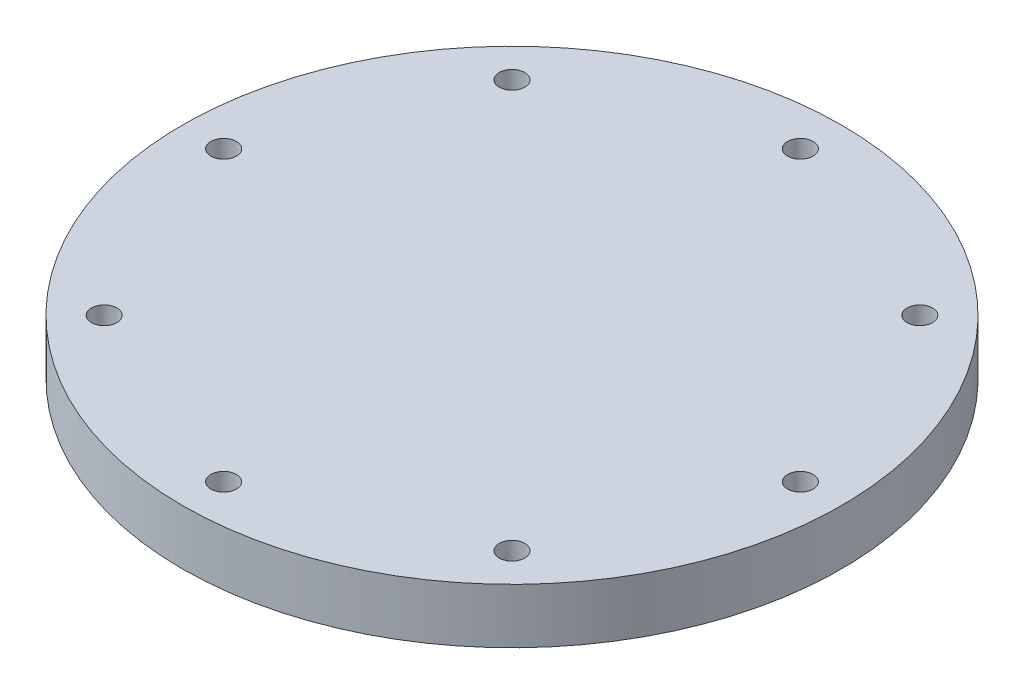
ISO-10303-21;
HEADER;
FILE_DESCRIPTION(('STEP AP214'),'2;1');
FILE_NAME('part.step','',(''),(''),'','','');
FILE_SCHEMA(('AUTOMOTIVE_DESIGN { 1 0 10303 214 1 1 1 1 }'));
ENDSEC;
DATA;
#1=APPLICATION_CONTEXT('core data for automotive mechanical design processes');
#2=APPLICATION_PROTOCOL_DEFINITION('international standard','automotive_design',2000,#1);
#3=PRODUCT_CONTEXT('',#1,'mechanical');
#4=PRODUCT('Part','Part','',(#3));
#5=PRODUCT_RELATED_PRODUCT_CATEGORY('part','',(#4));
#6=PRODUCT_DEFINITION_FORMATION('','',#4);
#7=PRODUCT_DEFINITION_CONTEXT('part definition',#1,'design');
#8=PRODUCT_DEFINITION('design','',#6,#7);
#9=PRODUCT_DEFINITION_SHAPE('','',#8);
#10=(LENGTH_UNIT() NAMED_UNIT(*) SI_UNIT(.MILLI.,.METRE.));
#11=(NAMED_UNIT(*) PLANE_ANGLE_UNIT() SI_UNIT($,.RADIAN.));
#12=(NAMED_UNIT(*) SI_UNIT($,.STERADIAN.) SOLID_ANGLE_UNIT());
#13=UNCERTAINTY_MEASURE_WITH_UNIT(LENGTH_MEASURE(1.E-05),#10,'distance_accuracy_value','');
#14=(GEOMETRIC_REPRESENTATION_CONTEXT(3) GLOBAL_UNCERTAINTY_ASSIGNED_CONTEXT((#13)) GLOBAL_UNIT_ASSIGNED_CONTEXT((#10,
#11,#12)) REPRESENTATION_CONTEXT('',''));
#15=CARTESIAN_POINT('',(0.,0.,0.));
#16=DIRECTION('',(0.,0.,1.));
#17=DIRECTION('',(1.,0.,0.));
#18=AXIS2_PLACEMENT_3D('',#15,#16,#17);
#19=CARTESIAN_POINT('',(0.,0.,0.));
#20=DIRECTION('',(0.,1.,0.));
#21=DIRECTION('',(0.,0.,1.));
#22=AXIS2_PLACEMENT_3D('',#19,#20,#21);
#23=PLANE('',#22);
#24=CARTESIAN_POINT('',(-23.5731723178062,0.,23.5731723178068));
#25=DIRECTION('',(0.,-1.,0.));
#26=DIRECTION('',(0.,0.,-1.));
#27=AXIS2_PLACEMENT_3D('',#24,#25,#26);
#28=CIRCLE('',#27,2.413);
#29=CARTESIAN_POINT('',(-23.5731723178062,0.,21.1601723178068));
#30=VERTEX_POINT('',#29);
#31=EDGE_CURVE('E135',#30,#30,#28,.T.);
#32=ORIENTED_EDGE('',*,*,#31,.F.);
#33=EDGE_LOOP('',(#32));
#34=FACE_BOUND('',#33,.T.);
#35=CARTESIAN_POINT('',(-33.3375,0.,3.49191777401049E-13));
#36=DIRECTION('',(0.,-1.,0.));
#37=DIRECTION('',(0.,0.,-1.));
#38=AXIS2_PLACEMENT_3D('',#35,#36,#37);
#39=CIRCLE('',#38,2.413);
#40=CARTESIAN_POINT('',(-33.3375,0.,-2.41299999999965));
#41=VERTEX_POINT('',#40);
#42=EDGE_CURVE('E123',#41,#41,#39,.T.);
#43=ORIENTED_EDGE('',*,*,#42,.F.);
#44=EDGE_LOOP('',(#43));
#45=FACE_BOUND('',#44,.T.);
#46=CARTESIAN_POINT('',(-23.5731723178067,0.,-23.5731723178063));
#47=DIRECTION('',(0.,-1.,0.));
#48=DIRECTION('',(0.,0.,-1.));
#49=AXIS2_PLACEMENT_3D('',#46,#47,#48);
#50=CIRCLE('',#49,2.413);
#51=CARTESIAN_POINT('',(-23.5731723178067,0.,-25.9861723178063));
#52=VERTEX_POINT('',#51);
#53=EDGE_CURVE('E111',#52,#52,#50,.T.);
#54=ORIENTED_EDGE('',*,*,#53,.F.);
#55=EDGE_LOOP('',(#54));
#56=FACE_BOUND('',#55,.T.);
#57=CARTESIAN_POINT('',(0.,0.,-33.3375));
#58=DIRECTION('',(0.,-1.,0.));
#59=DIRECTION('',(0.,0.,-1.));
#60=AXIS2_PLACEMENT_3D('',#57,#58,#59);
#61=CIRCLE('',#60,2.413);
#62=CARTESIAN_POINT('',(0.,0.,-35.7505));
#63=VERTEX_POINT('',#62);
#64=EDGE_CURVE('E99',#63,#63,#61,.T.);
#65=ORIENTED_EDGE('',*,*,#64,.F.);
#66=EDGE_LOOP('',(#65));
#67=FACE_BOUND('',#66,.T.);
#68=CARTESIAN_POINT('',(23.5731723178064,0.,-23.5731723178067));
#69=DIRECTION('',(0.,-1.,0.));
#70=DIRECTION('',(0.,0.,-1.));
#71=AXIS2_PLACEMENT_3D('',#68,#69,#70);
#72=CIRCLE('',#71,2.413);
#73=CARTESIAN_POINT('',(23.5731723178064,0.,-25.9861723178067));
#74=VERTEX_POINT('',#73);
#75=EDGE_CURVE('E87',#74,#74,#72,.T.);
#76=ORIENTED_EDGE('',*,*,#75,.F.);
#77=EDGE_LOOP('',(#76));
#78=FACE_BOUND('',#77,.T.);
#79=CARTESIAN_POINT('',(23.5731723178066,0.,23.5731723178065));
#80=DIRECTION('',(0.,-1.,0.));
#81=DIRECTION('',(0.,0.,-1.));
#82=AXIS2_PLACEMENT_3D('',#79,#80,#81);
#83=CIRCLE('',#82,2.413);
#84=CARTESIAN_POINT('',(23.5731723178066,0.,21.1601723178065));
#85=VERTEX_POINT('',#84);
#86=EDGE_CURVE('E63',#85,#85,#83,.T.);
#87=ORIENTED_EDGE('',*,*,#86,.F.);
#88=EDGE_LOOP('',(#87));
#89=FACE_BOUND('',#88,.T.);
#90=CARTESIAN_POINT('',(0.,0.,33.3375));
#91=DIRECTION('',(0.,-1.,0.));
#92=DIRECTION('',(0.,0.,-1.));
#93=AXIS2_PLACEMENT_3D('',#90,#91,#92);
#94=CIRCLE('',#93,2.413);
#95=CARTESIAN_POINT('',(0.,0.,30.9245));
#96=VERTEX_POINT('',#95);
#97=EDGE_CURVE('E51',#96,#96,#94,.T.);
#98=ORIENTED_EDGE('',*,*,#97,.F.);
#99=EDGE_LOOP('',(#98));
#100=FACE_BOUND('',#99,.T.);
#101=CARTESIAN_POINT('',(0.,0.,0.));
#102=DIRECTION('',(0.,1.,0.));
#103=DIRECTION('',(0.,0.,1.));
#104=AXIS2_PLACEMENT_3D('',#101,#102,#103);
#105=CIRCLE('',#104,38.1);
#106=CARTESIAN_POINT('',(0.,0.,38.1));
#107=VERTEX_POINT('',#106);
#108=EDGE_CURVE('E34',#107,#107,#105,.T.);
#109=ORIENTED_EDGE('',*,*,#108,.F.);
#110=EDGE_LOOP('',(#109));
#111=FACE_BOUND('',#110,.T.);
#112=CARTESIAN_POINT('',(33.3375,0.,-1.16397259133683E-13));
#113=DIRECTION('',(0.,-1.,0.));
#114=DIRECTION('',(0.,0.,-1.));
#115=AXIS2_PLACEMENT_3D('',#112,#113,#114);
#116=CIRCLE('',#115,2.413);
#117=CARTESIAN_POINT('',(33.3375,0.,-2.41300000000011));
#118=VERTEX_POINT('',#117);
#119=EDGE_CURVE('E75',#118,#118,#116,.T.);
#120=ORIENTED_EDGE('',*,*,#119,.F.);
#121=EDGE_LOOP('',(#120));
#122=FACE_BOUND('',#121,.T.);
#123=ADVANCED_FACE('F30',(#34,#45,#56,#67,#78,#89,#100,#111,#122),#23,.F.);
#124=CARTESIAN_POINT('',(0.,6.35,0.));
#125=DIRECTION('',(0.,-1.,0.));
#126=DIRECTION('',(0.,0.,-1.));
#127=AXIS2_PLACEMENT_3D('',#124,#125,#126);
#128=CYLINDRICAL_SURFACE('',#127,38.1);
#129=CARTESIAN_POINT('',(0.,6.35,0.));
#130=DIRECTION('',(0.,1.,0.));
#131=DIRECTION('',(0.,0.,1.));
#132=AXIS2_PLACEMENT_3D('',#129,#130,#131);
#133=CIRCLE('',#132,38.1);
#134=CARTESIAN_POINT('',(0.,6.35,38.1));
#135=VERTEX_POINT('',#134);
#136=EDGE_CURVE('E10',#135,#135,#133,.T.);
#137=ORIENTED_EDGE('',*,*,#136,.F.);
#138=EDGE_LOOP('',(#137));
#139=FACE_BOUND('',#138,.T.);
#140=ORIENTED_EDGE('',*,*,#108,.T.);
#141=EDGE_LOOP('',(#140));
#142=FACE_BOUND('',#141,.T.);
#143=ADVANCED_FACE('F32',(#139,#142),#128,.T.);
#144=CARTESIAN_POINT('',(0.,6.35,0.));
#145=DIRECTION('',(0.,1.,0.));
#146=DIRECTION('',(0.,0.,1.));
#147=AXIS2_PLACEMENT_3D('',#144,#145,#146);
#148=PLANE('',#147);
#149=CARTESIAN_POINT('',(-23.5731723178062,6.35,23.5731723178068));
#150=DIRECTION('',(0.,-1.,0.));
#151=DIRECTION('',(0.,0.,-1.));
#152=AXIS2_PLACEMENT_3D('',#149,#150,#151);
#153=CIRCLE('',#152,1.4732);
#154=CARTESIAN_POINT('',(-23.5731723178062,6.35,22.0999723178068));
#155=VERTEX_POINT('',#154);
#156=EDGE_CURVE('E126',#155,#155,#153,.T.);
#157=ORIENTED_EDGE('',*,*,#156,.T.);
#158=EDGE_LOOP('',(#157));
#159=FACE_BOUND('',#158,.T.);
#160=CARTESIAN_POINT('',(-33.3375,6.35,3.49191777401049E-13));
#161=DIRECTION('',(0.,-1.,0.));
#162=DIRECTION('',(0.,0.,-1.));
#163=AXIS2_PLACEMENT_3D('',#160,#161,#162);
#164=CIRCLE('',#163,1.4732);
#165=CARTESIAN_POINT('',(-33.3375,6.35,-1.47319999999965));
#166=VERTEX_POINT('',#165);
#167=EDGE_CURVE('E114',#166,#166,#164,.T.);
#168=ORIENTED_EDGE('',*,*,#167,.T.);
#169=EDGE_LOOP('',(#168));
#170=FACE_BOUND('',#169,.T.);
#171=CARTESIAN_POINT('',(-23.5731723178067,6.35,-23.5731723178063));
#172=DIRECTION('',(0.,-1.,0.));
#173=DIRECTION('',(0.,0.,-1.));
#174=AXIS2_PLACEMENT_3D('',#171,#172,#173);
#175=CIRCLE('',#174,1.4732);
#176=CARTESIAN_POINT('',(-23.5731723178067,6.35,-25.0463723178063));
#177=VERTEX_POINT('',#176);
#178=EDGE_CURVE('E102',#177,#177,#175,.T.);
#179=ORIENTED_EDGE('',*,*,#178,.T.);
#180=EDGE_LOOP('',(#179));
#181=FACE_BOUND('',#180,.T.);
#182=CARTESIAN_POINT('',(0.,6.35,-33.3375));
#183=DIRECTION('',(0.,-1.,0.));
#184=DIRECTION('',(0.,0.,-1.));
#185=AXIS2_PLACEMENT_3D('',#182,#183,#184);
#186=CIRCLE('',#185,1.4732);
#187=CARTESIAN_POINT('',(0.,6.35,-34.8107));
#188=VERTEX_POINT('',#187);
#189=EDGE_CURVE('E90',#188,#188,#186,.T.);
#190=ORIENTED_EDGE('',*,*,#189,.T.);
#191=EDGE_LOOP('',(#190));
#192=FACE_BOUND('',#191,.T.);
#193=CARTESIAN_POINT('',(23.5731723178064,6.35,-23.5731723178067));
#194=DIRECTION('',(0.,-1.,0.));
#195=DIRECTION('',(0.,0.,-1.));
#196=AXIS2_PLACEMENT_3D('',#193,#194,#195);
#197=CIRCLE('',#196,1.4732);
#198=CARTESIAN_POINT('',(23.5731723178064,6.35,-25.0463723178067));
#199=VERTEX_POINT('',#198);
#200=EDGE_CURVE('E78',#199,#199,#197,.T.);
#201=ORIENTED_EDGE('',*,*,#200,.T.);
#202=EDGE_LOOP('',(#201));
#203=FACE_BOUND('',#202,.T.);
#204=CARTESIAN_POINT('',(33.3375,6.35,-1.16397259133683E-13));
#205=DIRECTION('',(0.,-1.,0.));
#206=DIRECTION('',(0.,0.,-1.));
#207=AXIS2_PLACEMENT_3D('',#204,#205,#206);
#208=CIRCLE('',#207,1.4732);
#209=CARTESIAN_POINT('',(33.3375,6.35,-1.47320000000012));
#210=VERTEX_POINT('',#209);
#211=EDGE_CURVE('E66',#210,#210,#208,.T.);
#212=ORIENTED_EDGE('',*,*,#211,.T.);
#213=EDGE_LOOP('',(#212));
#214=FACE_BOUND('',#213,.T.);
#215=CARTESIAN_POINT('',(23.5731723178066,6.35,23.5731723178065));
#216=DIRECTION('',(0.,-1.,0.));
#217=DIRECTION('',(0.,0.,-1.));
#218=AXIS2_PLACEMENT_3D('',#215,#216,#217);
#219=CIRCLE('',#218,1.4732);
#220=CARTESIAN_POINT('',(23.5731723178066,6.35,22.0999723178065));
#221=VERTEX_POINT('',#220);
#222=EDGE_CURVE('E54',#221,#221,#219,.T.);
#223=ORIENTED_EDGE('',*,*,#222,.T.);
#224=EDGE_LOOP('',(#223));
#225=FACE_BOUND('',#224,.T.);
#226=CARTESIAN_POINT('',(0.,6.35,33.3375));
#227=DIRECTION('',(0.,-1.,0.));
#228=DIRECTION('',(0.,0.,-1.));
#229=AXIS2_PLACEMENT_3D('',#226,#227,#228);
#230=CIRCLE('',#229,1.4732);
#231=CARTESIAN_POINT('',(0.,6.35,31.8643));
#232=VERTEX_POINT('',#231);
#233=EDGE_CURVE('E41',#232,#232,#230,.T.);
#234=ORIENTED_EDGE('',*,*,#233,.T.);
#235=EDGE_LOOP('',(#234));
#236=FACE_BOUND('',#235,.T.);
#237=ORIENTED_EDGE('',*,*,#136,.T.);
#238=EDGE_LOOP('',(#237));
#239=FACE_BOUND('',#238,.T.);
#240=ADVANCED_FACE('F204',(#159,#170,#181,#192,#203,#214,#225,#236,#239),#148,.T.);
#241=CARTESIAN_POINT('',(0.,0.,33.3375));
#242=DIRECTION('',(0.,-1.,0.));
#243=DIRECTION('',(0.,0.,-1.));
#244=AXIS2_PLACEMENT_3D('',#241,#242,#243);
#245=CYLINDRICAL_SURFACE('',#244,1.4732);
#246=ORIENTED_EDGE('',*,*,#233,.F.);
#247=EDGE_LOOP('',(#246));
#248=FACE_BOUND('',#247,.T.);
#249=CARTESIAN_POINT('',(0.,2.8448,33.3375));
#250=DIRECTION('',(0.,-1.,0.));
#251=DIRECTION('',(0.,0.,-1.));
#252=AXIS2_PLACEMENT_3D('',#249,#250,#251);
#253=CIRCLE('',#252,1.4732);
#254=CARTESIAN_POINT('',(0.,2.8448,31.8643));
#255=VERTEX_POINT('',#254);
#256=EDGE_CURVE('E45',#255,#255,#253,.T.);
#257=ORIENTED_EDGE('',*,*,#256,.T.);
#258=EDGE_LOOP('',(#257));
#259=FACE_BOUND('',#258,.T.);
#260=ADVANCED_FACE('F200',(#248,#259),#245,.F.);
#261=CARTESIAN_POINT('',(1.4732,2.8448,33.3375));
#262=DIRECTION('',(0.,1.,0.));
#263=DIRECTION('',(0.,0.,1.));
#264=AXIS2_PLACEMENT_3D('',#261,#262,#263);
#265=PLANE('',#264);
#266=ORIENTED_EDGE('',*,*,#256,.F.);
#267=EDGE_LOOP('',(#266));
#268=FACE_BOUND('',#267,.T.);
#269=CARTESIAN_POINT('',(0.,2.8448,33.3375));
#270=DIRECTION('',(0.,-1.,0.));
#271=DIRECTION('',(0.,0.,-1.));
#272=AXIS2_PLACEMENT_3D('',#269,#270,#271);
#273=CIRCLE('',#272,2.413);
#274=CARTESIAN_POINT('',(0.,2.8448,30.9245));
#275=VERTEX_POINT('',#274);
#276=EDGE_CURVE('E48',#275,#275,#273,.T.);
#277=ORIENTED_EDGE('',*,*,#276,.T.);
#278=EDGE_LOOP('',(#277));
#279=FACE_BOUND('',#278,.T.);
#280=ADVANCED_FACE('F196',(#268,#279),#265,.F.);
#281=CARTESIAN_POINT('',(0.,0.,33.3375));
#282=DIRECTION('',(0.,-1.,0.));
#283=DIRECTION('',(0.,0.,-1.));
#284=AXIS2_PLACEMENT_3D('',#281,#282,#283);
#285=CYLINDRICAL_SURFACE('',#284,2.413);
#286=ORIENTED_EDGE('',*,*,#276,.F.);
#287=EDGE_LOOP('',(#286));
#288=FACE_BOUND('',#287,.T.);
#289=ORIENTED_EDGE('',*,*,#97,.T.);
#290=EDGE_LOOP('',(#289));
#291=FACE_BOUND('',#290,.T.);
#292=ADVANCED_FACE('F192',(#288,#291),#285,.F.);
#293=CARTESIAN_POINT('',(23.5731723178066,0.,23.5731723178065));
#294=DIRECTION('',(0.,-1.,0.));
#295=DIRECTION('',(0.,0.,-1.));
#296=AXIS2_PLACEMENT_3D('',#293,#294,#295);
#297=CYLINDRICAL_SURFACE('',#296,1.4732);
#298=ORIENTED_EDGE('',*,*,#222,.F.);
#299=EDGE_LOOP('',(#298));
#300=FACE_BOUND('',#299,.T.);
#301=CARTESIAN_POINT('',(23.5731723178066,2.8448,23.5731723178065));
#302=DIRECTION('',(0.,-1.,0.));
#303=DIRECTION('',(0.,0.,-1.));
#304=AXIS2_PLACEMENT_3D('',#301,#302,#303);
#305=CIRCLE('',#304,1.4732);
#306=CARTESIAN_POINT('',(23.5731723178066,2.8448,22.0999723178065));
#307=VERTEX_POINT('',#306);
#308=EDGE_CURVE('E57',#307,#307,#305,.T.);
#309=ORIENTED_EDGE('',*,*,#308,.T.);
#310=EDGE_LOOP('',(#309));
#311=FACE_BOUND('',#310,.T.);
#312=ADVANCED_FACE('F188',(#300,#311),#297,.F.);
#313=CARTESIAN_POINT('',(25.0463723178066,2.8448,23.5731723178065));
#314=DIRECTION('',(0.,1.,0.));
#315=DIRECTION('',(0.,0.,1.));
#316=AXIS2_PLACEMENT_3D('',#313,#314,#315);
#317=PLANE('',#316);
#318=ORIENTED_EDGE('',*,*,#308,.F.);
#319=EDGE_LOOP('',(#318));
#320=FACE_BOUND('',#319,.T.);
#321=CARTESIAN_POINT('',(23.5731723178066,2.8448,23.5731723178065));
#322=DIRECTION('',(0.,-1.,0.));
#323=DIRECTION('',(0.,0.,-1.));
#324=AXIS2_PLACEMENT_3D('',#321,#322,#323);
#325=CIRCLE('',#324,2.413);
#326=CARTESIAN_POINT('',(23.5731723178066,2.8448,21.1601723178065));
#327=VERTEX_POINT('',#326);
#328=EDGE_CURVE('E60',#327,#327,#325,.T.);
#329=ORIENTED_EDGE('',*,*,#328,.T.);
#330=EDGE_LOOP('',(#329));
#331=FACE_BOUND('',#330,.T.);
#332=ADVANCED_FACE('F184',(#320,#331),#317,.F.);
#333=CARTESIAN_POINT('',(23.5731723178066,0.,23.5731723178065));
#334=DIRECTION('',(0.,-1.,0.));
#335=DIRECTION('',(0.,0.,-1.));
#336=AXIS2_PLACEMENT_3D('',#333,#334,#335);
#337=CYLINDRICAL_SURFACE('',#336,2.413);
#338=ORIENTED_EDGE('',*,*,#328,.F.);
#339=EDGE_LOOP('',(#338));
#340=FACE_BOUND('',#339,.T.);
#341=ORIENTED_EDGE('',*,*,#86,.T.);
#342=EDGE_LOOP('',(#341));
#343=FACE_BOUND('',#342,.T.);
#344=ADVANCED_FACE('F180',(#340,#343),#337,.F.);
#345=CARTESIAN_POINT('',(33.3375,0.,-1.16397259133683E-13));
#346=DIRECTION('',(0.,-1.,0.));
#347=DIRECTION('',(0.,0.,-1.));
#348=AXIS2_PLACEMENT_3D('',#345,#346,#347);
#349=CYLINDRICAL_SURFACE('',#348,1.4732);
#350=ORIENTED_EDGE('',*,*,#211,.F.);
#351=EDGE_LOOP('',(#350));
#352=FACE_BOUND('',#351,.T.);
#353=CARTESIAN_POINT('',(33.3375,2.8448,-1.16397259133683E-13));
#354=DIRECTION('',(0.,-1.,0.));
#355=DIRECTION('',(0.,0.,-1.));
#356=AXIS2_PLACEMENT_3D('',#353,#354,#355);
#357=CIRCLE('',#356,1.4732);
#358=CARTESIAN_POINT('',(33.3375,2.8448,-1.47320000000012));
#359=VERTEX_POINT('',#358);
#360=EDGE_CURVE('E69',#359,#359,#357,.T.);
#361=ORIENTED_EDGE('',*,*,#360,.T.);
#362=EDGE_LOOP('',(#361));
#363=FACE_BOUND('',#362,.T.);
#364=ADVANCED_FACE('F172',(#352,#363),#349,.F.);
#365=CARTESIAN_POINT('',(34.8107,2.8448,-1.16397259133683E-13));
#366=DIRECTION('',(0.,1.,0.));
#367=DIRECTION('',(0.,0.,1.));
#368=AXIS2_PLACEMENT_3D('',#365,#366,#367);
#369=PLANE('',#368);
#370=ORIENTED_EDGE('',*,*,#360,.F.);
#371=EDGE_LOOP('',(#370));
#372=FACE_BOUND('',#371,.T.);
#373=CARTESIAN_POINT('',(33.3375,2.8448,-1.16397259133683E-13));
#374=DIRECTION('',(0.,-1.,0.));
#375=DIRECTION('',(0.,0.,-1.));
#376=AXIS2_PLACEMENT_3D('',#373,#374,#375);
#377=CIRCLE('',#376,2.413);
#378=CARTESIAN_POINT('',(33.3375,2.8448,-2.41300000000011));
#379=VERTEX_POINT('',#378);
#380=EDGE_CURVE('E72',#379,#379,#377,.T.);
#381=ORIENTED_EDGE('',*,*,#380,.T.);
#382=EDGE_LOOP('',(#381));
#383=FACE_BOUND('',#382,.T.);
#384=ADVANCED_FACE('F162',(#372,#383),#369,.F.);
#385=CARTESIAN_POINT('',(33.3375,0.,-1.16397259133683E-13));
#386=DIRECTION('',(0.,-1.,0.));
#387=DIRECTION('',(0.,0.,-1.));
#388=AXIS2_PLACEMENT_3D('',#385,#386,#387);
#389=CYLINDRICAL_SURFACE('',#388,2.413);
#390=ORIENTED_EDGE('',*,*,#380,.F.);
#391=EDGE_LOOP('',(#390));
#392=FACE_BOUND('',#391,.T.);
#393=ORIENTED_EDGE('',*,*,#119,.T.);
#394=EDGE_LOOP('',(#393));
#395=FACE_BOUND('',#394,.T.);
#396=ADVANCED_FACE('F159',(#392,#395),#389,.F.);
#397=CARTESIAN_POINT('',(23.5731723178064,0.,-23.5731723178067));
#398=DIRECTION('',(0.,-1.,0.));
#399=DIRECTION('',(0.,0.,-1.));
#400=AXIS2_PLACEMENT_3D('',#397,#398,#399);
#401=CYLINDRICAL_SURFACE('',#400,1.4732);
#402=ORIENTED_EDGE('',*,*,#200,.F.);
#403=EDGE_LOOP('',(#402));
#404=FACE_BOUND('',#403,.T.);
#405=CARTESIAN_POINT('',(23.5731723178064,2.8448,-23.5731723178067));
#406=DIRECTION('',(0.,-1.,0.));
#407=DIRECTION('',(0.,0.,-1.));
#408=AXIS2_PLACEMENT_3D('',#405,#406,#407);
#409=CIRCLE('',#408,1.4732);
#410=CARTESIAN_POINT('',(23.5731723178064,2.8448,-25.0463723178067));
#411=VERTEX_POINT('',#410);
#412=EDGE_CURVE('E81',#411,#411,#409,.T.);
#413=ORIENTED_EDGE('',*,*,#412,.T.);
#414=EDGE_LOOP('',(#413));
#415=FACE_BOUND('',#414,.T.);
#416=ADVANCED_FACE('F161',(#404,#415),#401,.F.);
#417=CARTESIAN_POINT('',(25.0463723178064,2.8448,-23.5731723178067));
#418=DIRECTION('',(0.,1.,0.));
#419=DIRECTION('',(0.,0.,1.));
#420=AXIS2_PLACEMENT_3D('',#417,#418,#419);
#421=PLANE('',#420);
#422=ORIENTED_EDGE('',*,*,#412,.F.);
#423=EDGE_LOOP('',(#422));
#424=FACE_BOUND('',#423,.T.);
#425=CARTESIAN_POINT('',(23.5731723178064,2.8448,-23.5731723178067));
#426=DIRECTION('',(0.,-1.,0.));
#427=DIRECTION('',(0.,0.,-1.));
#428=AXIS2_PLACEMENT_3D('',#425,#426,#427);
#429=CIRCLE('',#428,2.413);
#430=CARTESIAN_POINT('',(23.5731723178064,2.8448,-25.9861723178067));
#431=VERTEX_POINT('',#430);
#432=EDGE_CURVE('E84',#431,#431,#429,.T.);
#433=ORIENTED_EDGE('',*,*,#432,.T.);
#434=EDGE_LOOP('',(#433));
#435=FACE_BOUND('',#434,.T.);
#436=ADVANCED_FACE('F169',(#424,#435),#421,.F.);
#437=CARTESIAN_POINT('',(23.5731723178064,0.,-23.5731723178067));
#438=DIRECTION('',(0.,-1.,0.));
#439=DIRECTION('',(0.,0.,-1.));
#440=AXIS2_PLACEMENT_3D('',#437,#438,#439);
#441=CYLINDRICAL_SURFACE('',#440,2.413);
#442=ORIENTED_EDGE('',*,*,#432,.F.);
#443=EDGE_LOOP('',(#442));
#444=FACE_BOUND('',#443,.T.);
#445=ORIENTED_EDGE('',*,*,#75,.T.);
#446=EDGE_LOOP('',(#445));
#447=FACE_BOUND('',#446,.T.);
#448=ADVANCED_FACE('F245',(#444,#447),#441,.F.);
#449=CARTESIAN_POINT('',(0.,0.,-33.3375));
#450=DIRECTION('',(0.,-1.,0.));
#451=DIRECTION('',(0.,0.,-1.));
#452=AXIS2_PLACEMENT_3D('',#449,#450,#451);
#453=CYLINDRICAL_SURFACE('',#452,1.4732);
#454=ORIENTED_EDGE('',*,*,#189,.F.);
#455=EDGE_LOOP('',(#454));
#456=FACE_BOUND('',#455,.T.);
#457=CARTESIAN_POINT('',(0.,2.8448,-33.3375));
#458=DIRECTION('',(0.,-1.,0.));
#459=DIRECTION('',(0.,0.,-1.));
#460=AXIS2_PLACEMENT_3D('',#457,#458,#459);
#461=CIRCLE('',#460,1.4732);
#462=CARTESIAN_POINT('',(0.,2.8448,-34.8107));
#463=VERTEX_POINT('',#462);
#464=EDGE_CURVE('E93',#463,#463,#461,.T.);
#465=ORIENTED_EDGE('',*,*,#464,.T.);
#466=EDGE_LOOP('',(#465));
#467=FACE_BOUND('',#466,.T.);
#468=ADVANCED_FACE('F250',(#456,#467),#453,.F.);
#469=CARTESIAN_POINT('',(1.4732,2.8448,-33.3375));
#470=DIRECTION('',(0.,1.,0.));
#471=DIRECTION('',(0.,0.,1.));
#472=AXIS2_PLACEMENT_3D('',#469,#470,#471);
#473=PLANE('',#472);
#474=ORIENTED_EDGE('',*,*,#464,.F.);
#475=EDGE_LOOP('',(#474));
#476=FACE_BOUND('',#475,.T.);
#477=CARTESIAN_POINT('',(0.,2.8448,-33.3375));
#478=DIRECTION('',(0.,-1.,0.));
#479=DIRECTION('',(0.,0.,-1.));
#480=AXIS2_PLACEMENT_3D('',#477,#478,#479);
#481=CIRCLE('',#480,2.413);
#482=CARTESIAN_POINT('',(0.,2.8448,-35.7505));
#483=VERTEX_POINT('',#482);
#484=EDGE_CURVE('E96',#483,#483,#481,.T.);
#485=ORIENTED_EDGE('',*,*,#484,.T.);
#486=EDGE_LOOP('',(#485));
#487=FACE_BOUND('',#486,.T.);
#488=ADVANCED_FACE('F255',(#476,#487),#473,.F.);
#489=CARTESIAN_POINT('',(0.,0.,-33.3375));
#490=DIRECTION('',(0.,-1.,0.));
#491=DIRECTION('',(0.,0.,-1.));
#492=AXIS2_PLACEMENT_3D('',#489,#490,#491);
#493=CYLINDRICAL_SURFACE('',#492,2.413);
#494=ORIENTED_EDGE('',*,*,#484,.F.);
#495=EDGE_LOOP('',(#494));
#496=FACE_BOUND('',#495,.T.);
#497=ORIENTED_EDGE('',*,*,#64,.T.);
#498=EDGE_LOOP('',(#497));
#499=FACE_BOUND('',#498,.T.);
#500=ADVANCED_FACE('F261',(#496,#499),#493,.F.);
#501=CARTESIAN_POINT('',(-23.5731723178067,0.,-23.5731723178063));
#502=DIRECTION('',(0.,-1.,0.));
#503=DIRECTION('',(0.,0.,-1.));
#504=AXIS2_PLACEMENT_3D('',#501,#502,#503);
#505=CYLINDRICAL_SURFACE('',#504,1.4732);
#506=ORIENTED_EDGE('',*,*,#178,.F.);
#507=EDGE_LOOP('',(#506));
#508=FACE_BOUND('',#507,.T.);
#509=CARTESIAN_POINT('',(-23.5731723178067,2.8448,-23.5731723178063));
#510=DIRECTION('',(0.,-1.,0.));
#511=DIRECTION('',(0.,0.,-1.));
#512=AXIS2_PLACEMENT_3D('',#509,#510,#511);
#513=CIRCLE('',#512,1.4732);
#514=CARTESIAN_POINT('',(-23.5731723178067,2.8448,-25.0463723178063));
#515=VERTEX_POINT('',#514);
#516=EDGE_CURVE('E105',#515,#515,#513,.T.);
#517=ORIENTED_EDGE('',*,*,#516,.T.);
#518=EDGE_LOOP('',(#517));
#519=FACE_BOUND('',#518,.T.);
#520=ADVANCED_FACE('F265',(#508,#519),#505,.F.);
#521=CARTESIAN_POINT('',(-22.0999723178067,2.8448,-23.5731723178063));
#522=DIRECTION('',(0.,1.,0.));
#523=DIRECTION('',(0.,0.,1.));
#524=AXIS2_PLACEMENT_3D('',#521,#522,#523);
#525=PLANE('',#524);
#526=ORIENTED_EDGE('',*,*,#516,.F.);
#527=EDGE_LOOP('',(#526));
#528=FACE_BOUND('',#527,.T.);
#529=CARTESIAN_POINT('',(-23.5731723178067,2.8448,-23.5731723178063));
#530=DIRECTION('',(0.,-1.,0.));
#531=DIRECTION('',(0.,0.,-1.));
#532=AXIS2_PLACEMENT_3D('',#529,#530,#531);
#533=CIRCLE('',#532,2.413);
#534=CARTESIAN_POINT('',(-23.5731723178067,2.8448,-25.9861723178063));
#535=VERTEX_POINT('',#534);
#536=EDGE_CURVE('E108',#535,#535,#533,.T.);
#537=ORIENTED_EDGE('',*,*,#536,.T.);
#538=EDGE_LOOP('',(#537));
#539=FACE_BOUND('',#538,.T.);
#540=ADVANCED_FACE('F269',(#528,#539),#525,.F.);
#541=CARTESIAN_POINT('',(-23.5731723178067,0.,-23.5731723178063));
#542=DIRECTION('',(0.,-1.,0.));
#543=DIRECTION('',(0.,0.,-1.));
#544=AXIS2_PLACEMENT_3D('',#541,#542,#543);
#545=CYLINDRICAL_SURFACE('',#544,2.413);
#546=ORIENTED_EDGE('',*,*,#536,.F.);
#547=EDGE_LOOP('',(#546));
#548=FACE_BOUND('',#547,.T.);
#549=ORIENTED_EDGE('',*,*,#53,.T.);
#550=EDGE_LOOP('',(#549));
#551=FACE_BOUND('',#550,.T.);
#552=ADVANCED_FACE('F273',(#548,#551),#545,.F.);
#553=CARTESIAN_POINT('',(-33.3375,0.,3.49191777401049E-13));
#554=DIRECTION('',(0.,-1.,0.));
#555=DIRECTION('',(0.,0.,-1.));
#556=AXIS2_PLACEMENT_3D('',#553,#554,#555);
#557=CYLINDRICAL_SURFACE('',#556,1.4732);
#558=ORIENTED_EDGE('',*,*,#167,.F.);
#559=EDGE_LOOP('',(#558));
#560=FACE_BOUND('',#559,.T.);
#561=CARTESIAN_POINT('',(-33.3375,2.8448,3.49191777401049E-13));
#562=DIRECTION('',(0.,-1.,0.));
#563=DIRECTION('',(0.,0.,-1.));
#564=AXIS2_PLACEMENT_3D('',#561,#562,#563);
#565=CIRCLE('',#564,1.4732);
#566=CARTESIAN_POINT('',(-33.3375,2.8448,-1.47319999999965));
#567=VERTEX_POINT('',#566);
#568=EDGE_CURVE('E117',#567,#567,#565,.T.);
#569=ORIENTED_EDGE('',*,*,#568,.T.);
#570=EDGE_LOOP('',(#569));
#571=FACE_BOUND('',#570,.T.);
#572=ADVANCED_FACE('F277',(#560,#571),#557,.F.);
#573=CARTESIAN_POINT('',(-31.8643,2.8448,3.49191777401049E-13));
#574=DIRECTION('',(0.,1.,0.));
#575=DIRECTION('',(0.,0.,1.));
#576=AXIS2_PLACEMENT_3D('',#573,#574,#575);
#577=PLANE('',#576);
#578=ORIENTED_EDGE('',*,*,#568,.F.);
#579=EDGE_LOOP('',(#578));
#580=FACE_BOUND('',#579,.T.);
#581=CARTESIAN_POINT('',(-33.3375,2.8448,3.49191777401049E-13));
#582=DIRECTION('',(0.,-1.,0.));
#583=DIRECTION('',(0.,0.,-1.));
#584=AXIS2_PLACEMENT_3D('',#581,#582,#583);
#585=CIRCLE('',#584,2.413);
#586=CARTESIAN_POINT('',(-33.3375,2.8448,-2.41299999999965));
#587=VERTEX_POINT('',#586);
#588=EDGE_CURVE('E120',#587,#587,#585,.T.);
#589=ORIENTED_EDGE('',*,*,#588,.T.);
#590=EDGE_LOOP('',(#589));
#591=FACE_BOUND('',#590,.T.);
#592=ADVANCED_FACE('F281',(#580,#591),#577,.F.);
#593=CARTESIAN_POINT('',(-33.3375,0.,3.49191777401049E-13));
#594=DIRECTION('',(0.,-1.,0.));
#595=DIRECTION('',(0.,0.,-1.));
#596=AXIS2_PLACEMENT_3D('',#593,#594,#595);
#597=CYLINDRICAL_SURFACE('',#596,2.413);
#598=ORIENTED_EDGE('',*,*,#588,.F.);
#599=EDGE_LOOP('',(#598));
#600=FACE_BOUND('',#599,.T.);
#601=ORIENTED_EDGE('',*,*,#42,.T.);
#602=EDGE_LOOP('',(#601));
#603=FACE_BOUND('',#602,.T.);
#604=ADVANCED_FACE('F285',(#600,#603),#597,.F.);
#605=CARTESIAN_POINT('',(-23.5731723178062,0.,23.5731723178068));
#606=DIRECTION('',(0.,-1.,0.));
#607=DIRECTION('',(0.,0.,-1.));
#608=AXIS2_PLACEMENT_3D('',#605,#606,#607);
#609=CYLINDRICAL_SURFACE('',#608,1.4732);
#610=ORIENTED_EDGE('',*,*,#156,.F.);
#611=EDGE_LOOP('',(#610));
#612=FACE_BOUND('',#611,.T.);
#613=CARTESIAN_POINT('',(-23.5731723178062,2.8448,23.5731723178068));
#614=DIRECTION('',(0.,-1.,0.));
#615=DIRECTION('',(0.,0.,-1.));
#616=AXIS2_PLACEMENT_3D('',#613,#614,#615);
#617=CIRCLE('',#616,1.4732);
#618=CARTESIAN_POINT('',(-23.5731723178062,2.8448,22.0999723178068));
#619=VERTEX_POINT('',#618);
#620=EDGE_CURVE('E129',#619,#619,#617,.T.);
#621=ORIENTED_EDGE('',*,*,#620,.T.);
#622=EDGE_LOOP('',(#621));
#623=FACE_BOUND('',#622,.T.);
#624=ADVANCED_FACE('F289',(#612,#623),#609,.F.);
#625=CARTESIAN_POINT('',(-22.0999723178062,2.8448,23.5731723178068));
#626=DIRECTION('',(0.,1.,0.));
#627=DIRECTION('',(0.,0.,1.));
#628=AXIS2_PLACEMENT_3D('',#625,#626,#627);
#629=PLANE('',#628);
#630=ORIENTED_EDGE('',*,*,#620,.F.);
#631=EDGE_LOOP('',(#630));
#632=FACE_BOUND('',#631,.T.);
#633=CARTESIAN_POINT('',(-23.5731723178062,2.8448,23.5731723178068));
#634=DIRECTION('',(0.,-1.,0.));
#635=DIRECTION('',(0.,0.,-1.));
#636=AXIS2_PLACEMENT_3D('',#633,#634,#635);
#637=CIRCLE('',#636,2.413);
#638=CARTESIAN_POINT('',(-23.5731723178062,2.8448,21.1601723178068));
#639=VERTEX_POINT('',#638);
#640=EDGE_CURVE('E132',#639,#639,#637,.T.);
#641=ORIENTED_EDGE('',*,*,#640,.T.);
#642=EDGE_LOOP('',(#641));
#643=FACE_BOUND('',#642,.T.);
#644=ADVANCED_FACE('F293',(#632,#643),#629,.F.);
#645=CARTESIAN_POINT('',(-23.5731723178062,0.,23.5731723178068));
#646=DIRECTION('',(0.,-1.,0.));
#647=DIRECTION('',(0.,0.,-1.));
#648=AXIS2_PLACEMENT_3D('',#645,#646,#647);
#649=CYLINDRICAL_SURFACE('',#648,2.413);
#650=ORIENTED_EDGE('',*,*,#640,.F.);
#651=EDGE_LOOP('',(#650));
#652=FACE_BOUND('',#651,.T.);
#653=ORIENTED_EDGE('',*,*,#31,.T.);
#654=EDGE_LOOP('',(#653));
#655=FACE_BOUND('',#654,.T.);
#656=ADVANCED_FACE('F139',(#652,#655),#649,.F.);
#657=CLOSED_SHELL('',(#123,#143,#240,#260,#280,#292,#312,#332,#344,#364,#384,#396,#416,#436,
#448,#468,#488,#500,#520,#540,#552,#572,#592,#604,#624,#644,#656));
#658=MANIFOLD_SOLID_BREP('B2',#657);
#659=ADVANCED_BREP_SHAPE_REPRESENTATION('',(#18,#658),#14);
#660=SHAPE_DEFINITION_REPRESENTATION(#9,#659);
ENDSEC;
END-ISO-10303-21;
